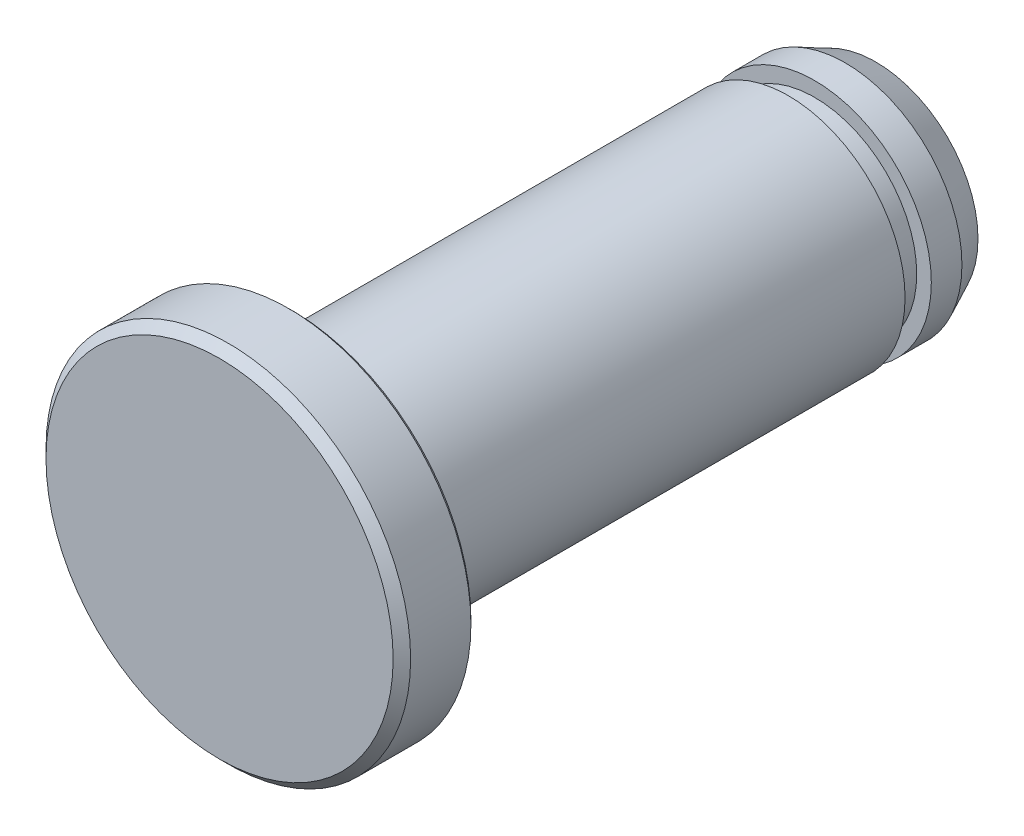
ISO-10303-21;
HEADER;
FILE_DESCRIPTION(('STEP AP214'),'2;1');
FILE_NAME('part.step','',(''),(''),'','','');
FILE_SCHEMA(('AUTOMOTIVE_DESIGN { 1 0 10303 214 1 1 1 1 }'));
ENDSEC;
DATA;
#1=APPLICATION_CONTEXT('core data for automotive mechanical design processes');
#2=APPLICATION_PROTOCOL_DEFINITION('international standard','automotive_design',2000,#1);
#3=PRODUCT_CONTEXT('',#1,'mechanical');
#4=PRODUCT('Part','Part','',(#3));
#5=PRODUCT_RELATED_PRODUCT_CATEGORY('part','',(#4));
#6=PRODUCT_DEFINITION_FORMATION('','',#4);
#7=PRODUCT_DEFINITION_CONTEXT('part definition',#1,'design');
#8=PRODUCT_DEFINITION('design','',#6,#7);
#9=PRODUCT_DEFINITION_SHAPE('','',#8);
#10=(LENGTH_UNIT() NAMED_UNIT(*) SI_UNIT(.MILLI.,.METRE.));
#11=(NAMED_UNIT(*) PLANE_ANGLE_UNIT() SI_UNIT($,.RADIAN.));
#12=(NAMED_UNIT(*) SI_UNIT($,.STERADIAN.) SOLID_ANGLE_UNIT());
#13=UNCERTAINTY_MEASURE_WITH_UNIT(LENGTH_MEASURE(1.E-05),#10,'distance_accuracy_value','');
#14=(GEOMETRIC_REPRESENTATION_CONTEXT(3) GLOBAL_UNCERTAINTY_ASSIGNED_CONTEXT((#13)) GLOBAL_UNIT_ASSIGNED_CONTEXT((#10,
#11,#12)) REPRESENTATION_CONTEXT('',''));
#15=CARTESIAN_POINT('',(0.,0.,0.));
#16=DIRECTION('',(0.,0.,1.));
#17=DIRECTION('',(1.,0.,0.));
#18=AXIS2_PLACEMENT_3D('',#15,#16,#17);
#19=CARTESIAN_POINT('',(0.,-5.95,7.));
#20=DIRECTION('',(0.,0.,-1.));
#21=DIRECTION('',(-1.,0.,0.));
#22=AXIS2_PLACEMENT_3D('',#19,#20,#21);
#23=PLANE('',#22);
#24=CARTESIAN_POINT('',(0.,0.,7.));
#25=DIRECTION('',(0.,0.,1.));
#26=DIRECTION('',(1.,0.,0.));
#27=AXIS2_PLACEMENT_3D('',#24,#25,#26);
#28=CIRCLE('',#27,5.95);
#29=CARTESIAN_POINT('',(5.95,0.,7.));
#30=VERTEX_POINT('',#29);
#31=EDGE_CURVE('E88',#30,#30,#28,.T.);
#32=ORIENTED_EDGE('',*,*,#31,.T.);
#33=EDGE_LOOP('',(#32));
#34=FACE_BOUND('',#33,.T.);
#35=ADVANCED_FACE('F37',(#34),#23,.F.);
#36=CARTESIAN_POINT('',(0.,0.,-15.5));
#37=DIRECTION('',(0.,0.,1.));
#38=DIRECTION('',(1.,0.,0.));
#39=AXIS2_PLACEMENT_3D('',#36,#37,#38);
#40=PLANE('',#39);
#41=CARTESIAN_POINT('',(0.,0.,-15.5));
#42=DIRECTION('',(0.,0.,1.));
#43=DIRECTION('',(1.,0.,0.));
#44=AXIS2_PLACEMENT_3D('',#41,#42,#43);
#45=CIRCLE('',#44,3.5);
#46=CARTESIAN_POINT('',(3.5,0.,-15.5));
#47=VERTEX_POINT('',#46);
#48=EDGE_CURVE('E10',#47,#47,#45,.T.);
#49=ORIENTED_EDGE('',*,*,#48,.F.);
#50=EDGE_LOOP('',(#49));
#51=FACE_BOUND('',#50,.T.);
#52=ADVANCED_FACE('F155',(#51),#40,.F.);
#53=CARTESIAN_POINT('',(0.,0.,-15.5));
#54=DIRECTION('',(0.,0.,1.));
#55=DIRECTION('',(1.,0.,0.));
#56=AXIS2_PLACEMENT_3D('',#53,#54,#55);
#57=CONICAL_SURFACE('',#56,3.5,0.444419209901099);
#58=CARTESIAN_POINT('',(0.,0.,-14.45));
#59=DIRECTION('',(0.,0.,1.));
#60=DIRECTION('',(1.,0.,0.));
#61=AXIS2_PLACEMENT_3D('',#58,#59,#60);
#62=CIRCLE('',#61,4.);
#63=CARTESIAN_POINT('',(4.,0.,-14.45));
#64=VERTEX_POINT('',#63);
#65=EDGE_CURVE('E44',#64,#64,#62,.T.);
#66=ORIENTED_EDGE('',*,*,#65,.F.);
#67=EDGE_LOOP('',(#66));
#68=FACE_BOUND('',#67,.T.);
#69=ORIENTED_EDGE('',*,*,#48,.T.);
#70=EDGE_LOOP('',(#69));
#71=FACE_BOUND('',#70,.T.);
#72=ADVANCED_FACE('F150',(#68,#71),#57,.T.);
#73=CARTESIAN_POINT('',(0.,0.,7.));
#74=DIRECTION('',(0.,0.,1.));
#75=DIRECTION('',(1.,0.,0.));
#76=AXIS2_PLACEMENT_3D('',#73,#74,#75);
#77=CYLINDRICAL_SURFACE('',#76,4.);
#78=CARTESIAN_POINT('',(0.,0.,-13.4));
#79=DIRECTION('',(0.,0.,1.));
#80=DIRECTION('',(1.,0.,0.));
#81=AXIS2_PLACEMENT_3D('',#78,#79,#80);
#82=CIRCLE('',#81,4.);
#83=CARTESIAN_POINT('',(4.,0.,-13.4));
#84=VERTEX_POINT('',#83);
#85=EDGE_CURVE('E49',#84,#84,#82,.T.);
#86=ORIENTED_EDGE('',*,*,#85,.F.);
#87=EDGE_LOOP('',(#86));
#88=FACE_BOUND('',#87,.T.);
#89=ORIENTED_EDGE('',*,*,#65,.T.);
#90=EDGE_LOOP('',(#89));
#91=FACE_BOUND('',#90,.T.);
#92=ADVANCED_FACE('F145',(#88,#91),#77,.T.);
#93=CARTESIAN_POINT('',(0.,-4.,-13.4));
#94=DIRECTION('',(0.,0.,-1.));
#95=DIRECTION('',(-1.,0.,0.));
#96=AXIS2_PLACEMENT_3D('',#93,#94,#95);
#97=PLANE('',#96);
#98=CARTESIAN_POINT('',(0.,0.,-13.4));
#99=DIRECTION('',(0.,0.,1.));
#100=DIRECTION('',(1.,0.,0.));
#101=AXIS2_PLACEMENT_3D('',#98,#99,#100);
#102=CIRCLE('',#101,3.5);
#103=CARTESIAN_POINT('',(3.5,0.,-13.4));
#104=VERTEX_POINT('',#103);
#105=EDGE_CURVE('E54',#104,#104,#102,.T.);
#106=ORIENTED_EDGE('',*,*,#105,.F.);
#107=EDGE_LOOP('',(#106));
#108=FACE_BOUND('',#107,.T.);
#109=ORIENTED_EDGE('',*,*,#85,.T.);
#110=EDGE_LOOP('',(#109));
#111=FACE_BOUND('',#110,.T.);
#112=ADVANCED_FACE('F139',(#108,#111),#97,.F.);
#113=CARTESIAN_POINT('',(0.,0.,7.));
#114=DIRECTION('',(0.,0.,1.));
#115=DIRECTION('',(1.,0.,0.));
#116=AXIS2_PLACEMENT_3D('',#113,#114,#115);
#117=CYLINDRICAL_SURFACE('',#116,3.5);
#118=CARTESIAN_POINT('',(0.,0.,-12.5));
#119=DIRECTION('',(0.,0.,1.));
#120=DIRECTION('',(1.,0.,0.));
#121=AXIS2_PLACEMENT_3D('',#118,#119,#120);
#122=CIRCLE('',#121,3.5);
#123=CARTESIAN_POINT('',(3.5,0.,-12.5));
#124=VERTEX_POINT('',#123);
#125=EDGE_CURVE('E60',#124,#124,#122,.T.);
#126=ORIENTED_EDGE('',*,*,#125,.F.);
#127=EDGE_LOOP('',(#126));
#128=FACE_BOUND('',#127,.T.);
#129=ORIENTED_EDGE('',*,*,#105,.T.);
#130=EDGE_LOOP('',(#129));
#131=FACE_BOUND('',#130,.T.);
#132=ADVANCED_FACE('F133',(#128,#131),#117,.T.);
#133=CARTESIAN_POINT('',(0.,-3.5,-12.5));
#134=DIRECTION('',(0.,0.,1.));
#135=DIRECTION('',(1.,0.,0.));
#136=AXIS2_PLACEMENT_3D('',#133,#134,#135);
#137=PLANE('',#136);
#138=CARTESIAN_POINT('',(0.,0.,-12.5));
#139=DIRECTION('',(0.,0.,1.));
#140=DIRECTION('',(1.,0.,0.));
#141=AXIS2_PLACEMENT_3D('',#138,#139,#140);
#142=CIRCLE('',#141,4.);
#143=CARTESIAN_POINT('',(4.,0.,-12.5));
#144=VERTEX_POINT('',#143);
#145=EDGE_CURVE('E64',#144,#144,#142,.T.);
#146=ORIENTED_EDGE('',*,*,#145,.F.);
#147=EDGE_LOOP('',(#146));
#148=FACE_BOUND('',#147,.T.);
#149=ORIENTED_EDGE('',*,*,#125,.T.);
#150=EDGE_LOOP('',(#149));
#151=FACE_BOUND('',#150,.T.);
#152=ADVANCED_FACE('F127',(#148,#151),#137,.F.);
#153=CARTESIAN_POINT('',(0.,0.,7.));
#154=DIRECTION('',(0.,0.,1.));
#155=DIRECTION('',(1.,0.,0.));
#156=AXIS2_PLACEMENT_3D('',#153,#154,#155);
#157=CYLINDRICAL_SURFACE('',#156,4.);
#158=CARTESIAN_POINT('',(0.,0.,4.33333333333333));
#159=DIRECTION('',(0.,0.,1.));
#160=DIRECTION('',(1.,0.,0.));
#161=AXIS2_PLACEMENT_3D('',#158,#159,#160);
#162=CIRCLE('',#161,4.);
#163=CARTESIAN_POINT('',(4.,0.,4.33333333333333));
#164=VERTEX_POINT('',#163);
#165=EDGE_CURVE('E68',#164,#164,#162,.T.);
#166=ORIENTED_EDGE('',*,*,#165,.F.);
#167=EDGE_LOOP('',(#166));
#168=FACE_BOUND('',#167,.T.);
#169=ORIENTED_EDGE('',*,*,#145,.T.);
#170=EDGE_LOOP('',(#169));
#171=FACE_BOUND('',#170,.T.);
#172=ADVANCED_FACE('F121',(#168,#171),#157,.T.);
#173=CARTESIAN_POINT('',(0.,0.,4.33333333333333));
#174=DIRECTION('',(0.,0.,1.));
#175=DIRECTION('',(1.,0.,0.));
#176=AXIS2_PLACEMENT_3D('',#173,#174,#175);
#177=TOROIDAL_SURFACE('',#176,4.16666666666666,0.166666666666666);
#178=CARTESIAN_POINT('',(0.,0.,4.5));
#179=DIRECTION('',(0.,0.,1.));
#180=DIRECTION('',(1.,0.,0.));
#181=AXIS2_PLACEMENT_3D('',#178,#179,#180);
#182=CIRCLE('',#181,4.16666666666666);
#183=CARTESIAN_POINT('',(4.16666666666666,0.,4.5));
#184=VERTEX_POINT('',#183);
#185=EDGE_CURVE('E72',#184,#184,#182,.T.);
#186=ORIENTED_EDGE('',*,*,#185,.F.);
#187=EDGE_LOOP('',(#186));
#188=FACE_BOUND('',#187,.T.);
#189=ORIENTED_EDGE('',*,*,#165,.T.);
#190=EDGE_LOOP('',(#189));
#191=FACE_BOUND('',#190,.T.);
#192=ADVANCED_FACE('F115',(#188,#191),#177,.F.);
#193=CARTESIAN_POINT('',(0.,-4.16666666666666,4.5));
#194=DIRECTION('',(0.,0.,1.));
#195=DIRECTION('',(1.,0.,0.));
#196=AXIS2_PLACEMENT_3D('',#193,#194,#195);
#197=PLANE('',#196);
#198=CARTESIAN_POINT('',(0.,0.,4.5));
#199=DIRECTION('',(0.,0.,1.));
#200=DIRECTION('',(1.,0.,0.));
#201=AXIS2_PLACEMENT_3D('',#198,#199,#200);
#202=CIRCLE('',#201,6.11666666666667);
#203=CARTESIAN_POINT('',(6.11666666666667,0.,4.5));
#204=VERTEX_POINT('',#203);
#205=EDGE_CURVE('E76',#204,#204,#202,.T.);
#206=ORIENTED_EDGE('',*,*,#205,.F.);
#207=EDGE_LOOP('',(#206));
#208=FACE_BOUND('',#207,.T.);
#209=ORIENTED_EDGE('',*,*,#185,.T.);
#210=EDGE_LOOP('',(#209));
#211=FACE_BOUND('',#210,.T.);
#212=ADVANCED_FACE('F109',(#208,#211),#197,.F.);
#213=CARTESIAN_POINT('',(0.,0.,4.5));
#214=DIRECTION('',(0.,0.,1.));
#215=DIRECTION('',(1.,0.,0.));
#216=AXIS2_PLACEMENT_3D('',#213,#214,#215);
#217=CONICAL_SURFACE('',#216,6.11666666666667,0.785398163397445);
#218=CARTESIAN_POINT('',(0.,0.,4.63333333333333));
#219=DIRECTION('',(0.,0.,1.));
#220=DIRECTION('',(1.,0.,0.));
#221=AXIS2_PLACEMENT_3D('',#218,#219,#220);
#222=CIRCLE('',#221,6.25);
#223=CARTESIAN_POINT('',(6.25,0.,4.63333333333333));
#224=VERTEX_POINT('',#223);
#225=EDGE_CURVE('E80',#224,#224,#222,.T.);
#226=ORIENTED_EDGE('',*,*,#225,.F.);
#227=EDGE_LOOP('',(#226));
#228=FACE_BOUND('',#227,.T.);
#229=ORIENTED_EDGE('',*,*,#205,.T.);
#230=EDGE_LOOP('',(#229));
#231=FACE_BOUND('',#230,.T.);
#232=ADVANCED_FACE('F103',(#228,#231),#217,.T.);
#233=CARTESIAN_POINT('',(0.,0.,7.));
#234=DIRECTION('',(0.,0.,1.));
#235=DIRECTION('',(1.,0.,0.));
#236=AXIS2_PLACEMENT_3D('',#233,#234,#235);
#237=CYLINDRICAL_SURFACE('',#236,6.25);
#238=CARTESIAN_POINT('',(0.,0.,6.7));
#239=DIRECTION('',(0.,0.,1.));
#240=DIRECTION('',(1.,0.,0.));
#241=AXIS2_PLACEMENT_3D('',#238,#239,#240);
#242=CIRCLE('',#241,6.25);
#243=CARTESIAN_POINT('',(6.25,0.,6.7));
#244=VERTEX_POINT('',#243);
#245=EDGE_CURVE('E84',#244,#244,#242,.T.);
#246=ORIENTED_EDGE('',*,*,#245,.F.);
#247=EDGE_LOOP('',(#246));
#248=FACE_BOUND('',#247,.T.);
#249=ORIENTED_EDGE('',*,*,#225,.T.);
#250=EDGE_LOOP('',(#249));
#251=FACE_BOUND('',#250,.T.);
#252=ADVANCED_FACE('F97',(#248,#251),#237,.T.);
#253=CARTESIAN_POINT('',(0.,0.,6.7));
#254=DIRECTION('',(0.,0.,-1.));
#255=DIRECTION('',(-1.,0.,0.));
#256=AXIS2_PLACEMENT_3D('',#253,#254,#255);
#257=CONICAL_SURFACE('',#256,6.25,0.785398163397441);
#258=ORIENTED_EDGE('',*,*,#31,.F.);
#259=EDGE_LOOP('',(#258));
#260=FACE_BOUND('',#259,.T.);
#261=ORIENTED_EDGE('',*,*,#245,.T.);
#262=EDGE_LOOP('',(#261));
#263=FACE_BOUND('',#262,.T.);
#264=ADVANCED_FACE('F94',(#260,#263),#257,.T.);
#265=CLOSED_SHELL('',(#35,#52,#72,#92,#112,#132,#152,#172,#192,#212,#232,#252,#264));
#266=MANIFOLD_SOLID_BREP('B2',#265);
#267=ADVANCED_BREP_SHAPE_REPRESENTATION('',(#18,#266),#14);
#268=SHAPE_DEFINITION_REPRESENTATION(#9,#267);
ENDSEC;
END-ISO-10303-21;
